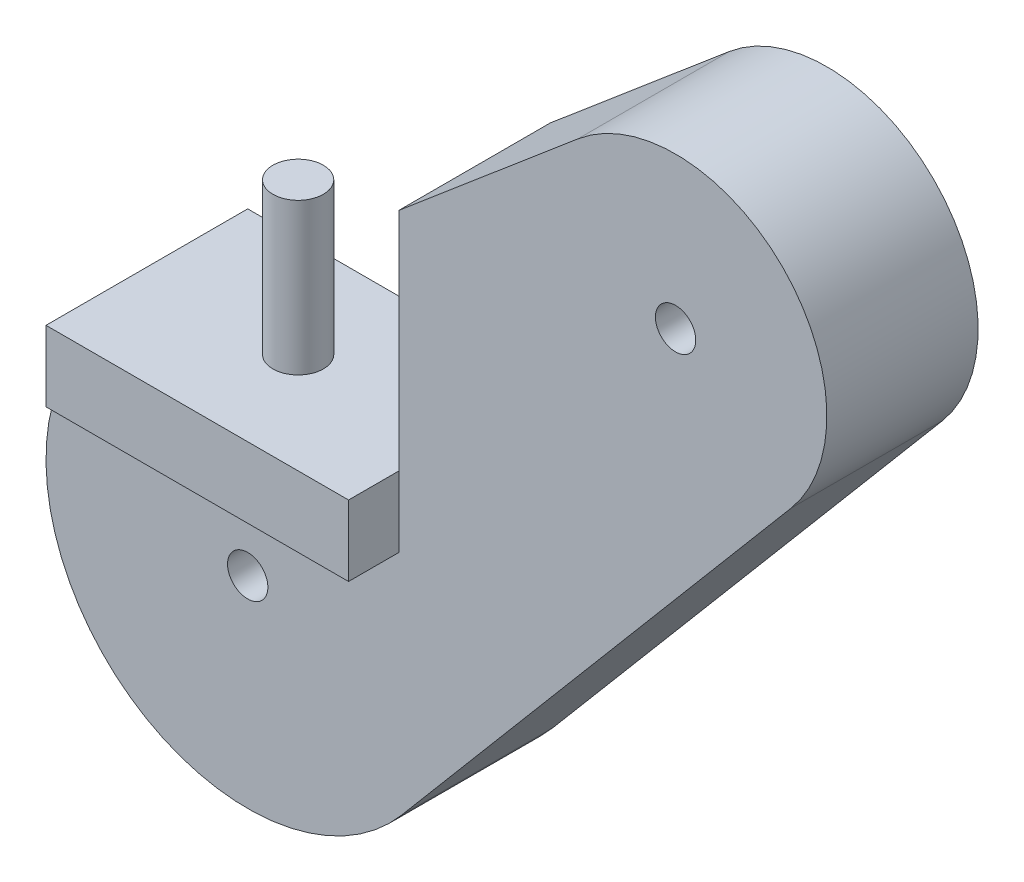
ISO-10303-21;
HEADER;
FILE_DESCRIPTION(('STEP AP214'),'2;1');
FILE_NAME('part.step','',(''),(''),'','','');
FILE_SCHEMA(('AUTOMOTIVE_DESIGN { 1 0 10303 214 1 1 1 1 }'));
ENDSEC;
DATA;
#1=APPLICATION_CONTEXT('core data for automotive mechanical design processes');
#2=APPLICATION_PROTOCOL_DEFINITION('international standard','automotive_design',2000,#1);
#3=PRODUCT_CONTEXT('',#1,'mechanical');
#4=PRODUCT('Part','Part','',(#3));
#5=PRODUCT_RELATED_PRODUCT_CATEGORY('part','',(#4));
#6=PRODUCT_DEFINITION_FORMATION('','',#4);
#7=PRODUCT_DEFINITION_CONTEXT('part definition',#1,'design');
#8=PRODUCT_DEFINITION('design','',#6,#7);
#9=PRODUCT_DEFINITION_SHAPE('','',#8);
#10=(LENGTH_UNIT() NAMED_UNIT(*) SI_UNIT(.MILLI.,.METRE.));
#11=(NAMED_UNIT(*) PLANE_ANGLE_UNIT() SI_UNIT($,.RADIAN.));
#12=(NAMED_UNIT(*) SI_UNIT($,.STERADIAN.) SOLID_ANGLE_UNIT());
#13=UNCERTAINTY_MEASURE_WITH_UNIT(LENGTH_MEASURE(1.E-05),#10,'distance_accuracy_value','');
#14=(GEOMETRIC_REPRESENTATION_CONTEXT(3) GLOBAL_UNCERTAINTY_ASSIGNED_CONTEXT((#13)) GLOBAL_UNIT_ASSIGNED_CONTEXT((#10,
#11,#12)) REPRESENTATION_CONTEXT('',''));
#15=CARTESIAN_POINT('',(0.,0.,0.));
#16=DIRECTION('',(0.,0.,1.));
#17=DIRECTION('',(1.,0.,0.));
#18=AXIS2_PLACEMENT_3D('',#15,#16,#17);
#19=CARTESIAN_POINT('',(0.,0.,15.));
#20=DIRECTION('',(0.,0.,-1.));
#21=DIRECTION('',(-1.,0.,0.));
#22=AXIS2_PLACEMENT_3D('',#19,#20,#21);
#23=CYLINDRICAL_SURFACE('',#22,20.);
#24=CARTESIAN_POINT('',(0.,0.,15.));
#25=DIRECTION('',(0.,0.,1.));
#26=DIRECTION('',(1.,0.,0.));
#27=AXIS2_PLACEMENT_3D('',#24,#25,#26);
#28=CIRCLE('',#27,20.);
#29=CARTESIAN_POINT('',(-15.,13.228756555323,15.));
#30=VERTEX_POINT('',#29);
#31=CARTESIAN_POINT('',(15.2714567397174,-12.9144341357622,15.));
#32=VERTEX_POINT('',#31);
#33=EDGE_CURVE('E181',#30,#32,#28,.T.);
#34=ORIENTED_EDGE('',*,*,#33,.F.);
#35=DIRECTION('',(0.,0.,-1.));
#36=VECTOR('',#35,1.);
#37=CARTESIAN_POINT('',(-15.,13.228756555323,15.));
#38=LINE('',#37,#36);
#39=CARTESIAN_POINT('',(-15.,13.228756555323,0.));
#40=VERTEX_POINT('',#39);
#41=EDGE_CURVE('E164',#30,#40,#38,.T.);
#42=ORIENTED_EDGE('',*,*,#41,.T.);
#43=CARTESIAN_POINT('',(0.,0.,0.));
#44=DIRECTION('',(0.,0.,1.));
#45=DIRECTION('',(1.,0.,0.));
#46=AXIS2_PLACEMENT_3D('',#43,#44,#45);
#47=CIRCLE('',#46,20.);
#48=CARTESIAN_POINT('',(15.2714567397174,-12.9144341357622,0.));
#49=VERTEX_POINT('',#48);
#50=EDGE_CURVE('E172',#40,#49,#47,.T.);
#51=ORIENTED_EDGE('',*,*,#50,.T.);
#52=DIRECTION('',(0.,0.,-1.));
#53=VECTOR('',#52,1.);
#54=CARTESIAN_POINT('',(15.2714567397174,-12.9144341357622,15.));
#55=LINE('',#54,#53);
#56=EDGE_CURVE('E11',#32,#49,#55,.T.);
#57=ORIENTED_EDGE('',*,*,#56,.F.);
#58=EDGE_LOOP('',(#34,#42,#51,#57));
#59=FACE_BOUND('',#58,.T.);
#60=ADVANCED_FACE('F37',(#59),#23,.T.);
#61=CARTESIAN_POINT('',(53.8799994259808,32.7405812693713,15.));
#62=DIRECTION('',(-0.76357283698587,0.64572170678811,0.));
#63=DIRECTION('',(-0.64572170678811,-0.763572836985871,0.));
#64=AXIS2_PLACEMENT_3D('',#61,#62,#63);
#65=PLANE('',#64);
#66=DIRECTION('',(0.64572170678811,0.76357283698587,0.));
#67=VECTOR('',#66,1.);
#68=CARTESIAN_POINT('',(53.8799994259808,32.7405812693713,0.));
#69=LINE('',#68,#67);
#70=CARTESIAN_POINT('',(53.8799994259808,32.7405812693713,0.));
#71=VERTEX_POINT('',#70);
#72=EDGE_CURVE('E193',#49,#71,#69,.T.);
#73=ORIENTED_EDGE('',*,*,#72,.T.);
#74=DIRECTION('',(0.,0.,-1.));
#75=VECTOR('',#74,1.);
#76=CARTESIAN_POINT('',(53.8799994259808,32.7405812693713,15.));
#77=LINE('',#76,#75);
#78=CARTESIAN_POINT('',(53.8799994259808,32.7405812693713,15.));
#79=VERTEX_POINT('',#78);
#80=EDGE_CURVE('E44',#79,#71,#77,.T.);
#81=ORIENTED_EDGE('',*,*,#80,.F.);
#82=DIRECTION('',(0.64572170678811,0.76357283698587,0.));
#83=VECTOR('',#82,1.);
#84=CARTESIAN_POINT('',(53.8799994259808,32.7405812693713,15.));
#85=LINE('',#84,#83);
#86=EDGE_CURVE('E183',#32,#79,#85,.T.);
#87=ORIENTED_EDGE('',*,*,#86,.F.);
#88=ORIENTED_EDGE('',*,*,#56,.T.);
#89=EDGE_LOOP('',(#73,#81,#87,#88));
#90=FACE_BOUND('',#89,.T.);
#91=ADVANCED_FACE('F216',(#90),#65,.F.);
#92=CARTESIAN_POINT('',(42.4264068711928,42.4264068711929,15.));
#93=DIRECTION('',(0.,0.,-1.));
#94=DIRECTION('',(-1.,0.,0.));
#95=AXIS2_PLACEMENT_3D('',#92,#93,#94);
#96=CYLINDRICAL_SURFACE('',#95,15.);
#97=CARTESIAN_POINT('',(42.4264068711928,42.4264068711929,0.));
#98=DIRECTION('',(0.,0.,1.));
#99=DIRECTION('',(-1.,0.,0.));
#100=AXIS2_PLACEMENT_3D('',#97,#98,#99);
#101=CIRCLE('',#100,15.);
#102=CARTESIAN_POINT('',(32.7405812693711,53.8799994259809,0.));
#103=VERTEX_POINT('',#102);
#104=EDGE_CURVE('E195',#71,#103,#101,.T.);
#105=ORIENTED_EDGE('',*,*,#104,.T.);
#106=DIRECTION('',(0.,0.,-1.));
#107=VECTOR('',#106,1.);
#108=CARTESIAN_POINT('',(32.7405812693711,53.8799994259809,15.));
#109=LINE('',#108,#107);
#110=CARTESIAN_POINT('',(32.7405812693711,53.8799994259809,15.));
#111=VERTEX_POINT('',#110);
#112=EDGE_CURVE('E191',#111,#103,#109,.T.);
#113=ORIENTED_EDGE('',*,*,#112,.F.);
#114=CARTESIAN_POINT('',(42.4264068711928,42.4264068711929,15.));
#115=DIRECTION('',(0.,0.,1.));
#116=DIRECTION('',(-1.,0.,0.));
#117=AXIS2_PLACEMENT_3D('',#114,#115,#116);
#118=CIRCLE('',#117,15.);
#119=EDGE_CURVE('E186',#79,#111,#118,.T.);
#120=ORIENTED_EDGE('',*,*,#119,.F.);
#121=ORIENTED_EDGE('',*,*,#80,.T.);
#122=EDGE_LOOP('',(#105,#113,#120,#121));
#123=FACE_BOUND('',#122,.T.);
#124=ADVANCED_FACE('F204',(#123),#96,.T.);
#125=CARTESIAN_POINT('',(-12.9144341357623,15.2714567397174,15.));
#126=DIRECTION('',(0.645721706788113,-0.763572836985868,0.));
#127=DIRECTION('',(0.763572836985868,0.645721706788113,0.));
#128=AXIS2_PLACEMENT_3D('',#125,#126,#127);
#129=PLANE('',#128);
#130=DIRECTION('',(-0.763572836985868,-0.645721706788113,0.));
#131=VECTOR('',#130,1.);
#132=CARTESIAN_POINT('',(-12.9144341357623,15.2714567397174,0.));
#133=LINE('',#132,#131);
#134=CARTESIAN_POINT('',(15.,38.8775296394823,0.));
#135=VERTEX_POINT('',#134);
#136=EDGE_CURVE('E184',#103,#135,#133,.T.);
#137=ORIENTED_EDGE('',*,*,#136,.T.);
#138=DIRECTION('',(0.,0.,1.));
#139=VECTOR('',#138,1.);
#140=CARTESIAN_POINT('',(15.,38.8775296394823,15.));
#141=LINE('',#140,#139);
#142=CARTESIAN_POINT('',(15.,38.8775296394823,15.));
#143=VERTEX_POINT('',#142);
#144=EDGE_CURVE('E130',#135,#143,#141,.T.);
#145=ORIENTED_EDGE('',*,*,#144,.T.);
#146=DIRECTION('',(-0.763572836985868,-0.645721706788113,0.));
#147=VECTOR('',#146,1.);
#148=CARTESIAN_POINT('',(-12.9144341357623,15.2714567397174,15.));
#149=LINE('',#148,#147);
#150=EDGE_CURVE('E188',#111,#143,#149,.T.);
#151=ORIENTED_EDGE('',*,*,#150,.F.);
#152=ORIENTED_EDGE('',*,*,#112,.T.);
#153=EDGE_LOOP('',(#137,#145,#151,#152));
#154=FACE_BOUND('',#153,.T.);
#155=ADVANCED_FACE('F210',(#154),#129,.F.);
#156=CARTESIAN_POINT('',(0.,0.,15.));
#157=DIRECTION('',(0.,0.,1.));
#158=DIRECTION('',(1.,0.,0.));
#159=AXIS2_PLACEMENT_3D('',#156,#157,#158);
#160=PLANE('',#159);
#161=DIRECTION('',(0.,1.,0.));
#162=VECTOR('',#161,1.);
#163=CARTESIAN_POINT('',(15.,16.5,15.));
#164=LINE('',#163,#162);
#165=CARTESIAN_POINT('',(15.,16.5,15.));
#166=VERTEX_POINT('',#165);
#167=EDGE_CURVE('E134',#166,#143,#164,.T.);
#168=ORIENTED_EDGE('',*,*,#167,.F.);
#169=DIRECTION('',(0.,1.,0.));
#170=VECTOR('',#169,1.);
#171=CARTESIAN_POINT('',(15.,0.,15.));
#172=LINE('',#171,#170);
#173=CARTESIAN_POINT('',(15.,9.5,15.));
#174=VERTEX_POINT('',#173);
#175=EDGE_CURVE('E56',#174,#166,#172,.T.);
#176=ORIENTED_EDGE('',*,*,#175,.F.);
#177=DIRECTION('',(1.,0.,0.));
#178=VECTOR('',#177,1.);
#179=CARTESIAN_POINT('',(0.,9.5,15.));
#180=LINE('',#179,#178);
#181=CARTESIAN_POINT('',(-15.,9.5,15.));
#182=VERTEX_POINT('',#181);
#183=EDGE_CURVE('E51',#182,#174,#180,.T.);
#184=ORIENTED_EDGE('',*,*,#183,.F.);
#185=DIRECTION('',(0.,-1.,0.));
#186=VECTOR('',#185,1.);
#187=CARTESIAN_POINT('',(-15.,0.,15.));
#188=LINE('',#187,#186);
#189=EDGE_CURVE('E157',#30,#182,#188,.T.);
#190=ORIENTED_EDGE('',*,*,#189,.F.);
#191=ORIENTED_EDGE('',*,*,#33,.T.);
#192=ORIENTED_EDGE('',*,*,#86,.T.);
#193=ORIENTED_EDGE('',*,*,#119,.T.);
#194=ORIENTED_EDGE('',*,*,#150,.T.);
#195=EDGE_LOOP('',(#168,#176,#184,#190,#191,#192,#193,#194));
#196=FACE_BOUND('',#195,.T.);
#197=CARTESIAN_POINT('',(0.,0.,15.));
#198=DIRECTION('',(0.,0.,1.));
#199=DIRECTION('',(1.,0.,0.));
#200=AXIS2_PLACEMENT_3D('',#197,#198,#199);
#201=CIRCLE('',#200,2.);
#202=CARTESIAN_POINT('',(2.,0.,15.));
#203=VERTEX_POINT('',#202);
#204=EDGE_CURVE('E173',#203,#203,#201,.T.);
#205=ORIENTED_EDGE('',*,*,#204,.F.);
#206=EDGE_LOOP('',(#205));
#207=FACE_BOUND('',#206,.T.);
#208=CARTESIAN_POINT('',(42.4264068711928,42.4264068711929,15.));
#209=DIRECTION('',(0.,0.,1.));
#210=DIRECTION('',(1.,0.,0.));
#211=AXIS2_PLACEMENT_3D('',#208,#209,#210);
#212=CIRCLE('',#211,2.);
#213=CARTESIAN_POINT('',(44.4264068711928,42.4264068711929,15.));
#214=VERTEX_POINT('',#213);
#215=EDGE_CURVE('E176',#214,#214,#212,.T.);
#216=ORIENTED_EDGE('',*,*,#215,.F.);
#217=EDGE_LOOP('',(#216));
#218=FACE_BOUND('',#217,.T.);
#219=ADVANCED_FACE('F212',(#196,#207,#218),#160,.T.);
#220=CARTESIAN_POINT('',(0.,0.,0.));
#221=DIRECTION('',(0.,0.,1.));
#222=DIRECTION('',(1.,0.,0.));
#223=AXIS2_PLACEMENT_3D('',#220,#221,#222);
#224=PLANE('',#223);
#225=DIRECTION('',(-1.,0.,0.));
#226=VECTOR('',#225,1.);
#227=CARTESIAN_POINT('',(-15.,16.5,0.));
#228=LINE('',#227,#226);
#229=CARTESIAN_POINT('',(15.,16.5,0.));
#230=VERTEX_POINT('',#229);
#231=CARTESIAN_POINT('',(-15.,16.5,0.));
#232=VERTEX_POINT('',#231);
#233=EDGE_CURVE('E109',#230,#232,#228,.T.);
#234=ORIENTED_EDGE('',*,*,#233,.F.);
#235=DIRECTION('',(0.,1.,0.));
#236=VECTOR('',#235,1.);
#237=CARTESIAN_POINT('',(15.,16.5,0.));
#238=LINE('',#237,#236);
#239=EDGE_CURVE('E115',#230,#135,#238,.T.);
#240=ORIENTED_EDGE('',*,*,#239,.T.);
#241=ORIENTED_EDGE('',*,*,#136,.F.);
#242=ORIENTED_EDGE('',*,*,#104,.F.);
#243=ORIENTED_EDGE('',*,*,#72,.F.);
#244=ORIENTED_EDGE('',*,*,#50,.F.);
#245=DIRECTION('',(0.,-1.,0.));
#246=VECTOR('',#245,1.);
#247=CARTESIAN_POINT('',(-15.,9.5,0.));
#248=LINE('',#247,#246);
#249=EDGE_CURVE('E119',#232,#40,#248,.T.);
#250=ORIENTED_EDGE('',*,*,#249,.F.);
#251=EDGE_LOOP('',(#234,#240,#241,#242,#243,#244,#250));
#252=FACE_BOUND('',#251,.T.);
#253=CARTESIAN_POINT('',(0.,0.,0.));
#254=DIRECTION('',(0.,0.,1.));
#255=DIRECTION('',(1.,0.,0.));
#256=AXIS2_PLACEMENT_3D('',#253,#254,#255);
#257=CIRCLE('',#256,2.);
#258=CARTESIAN_POINT('',(2.,0.,0.));
#259=VERTEX_POINT('',#258);
#260=EDGE_CURVE('E169',#259,#259,#257,.T.);
#261=ORIENTED_EDGE('',*,*,#260,.T.);
#262=EDGE_LOOP('',(#261));
#263=FACE_BOUND('',#262,.T.);
#264=CARTESIAN_POINT('',(42.4264068711928,42.4264068711929,0.));
#265=DIRECTION('',(0.,0.,1.));
#266=DIRECTION('',(1.,0.,0.));
#267=AXIS2_PLACEMENT_3D('',#264,#265,#266);
#268=CIRCLE('',#267,2.);
#269=CARTESIAN_POINT('',(44.4264068711928,42.4264068711929,0.));
#270=VERTEX_POINT('',#269);
#271=EDGE_CURVE('E168',#270,#270,#268,.T.);
#272=ORIENTED_EDGE('',*,*,#271,.T.);
#273=EDGE_LOOP('',(#272));
#274=FACE_BOUND('',#273,.T.);
#275=ADVANCED_FACE('F111',(#252,#263,#274),#224,.F.);
#276=CARTESIAN_POINT('',(42.4264068711928,42.4264068711929,0.));
#277=DIRECTION('',(0.,0.,1.));
#278=DIRECTION('',(1.,0.,0.));
#279=AXIS2_PLACEMENT_3D('',#276,#277,#278);
#280=CYLINDRICAL_SURFACE('',#279,2.);
#281=ORIENTED_EDGE('',*,*,#271,.F.);
#282=EDGE_LOOP('',(#281));
#283=FACE_BOUND('',#282,.T.);
#284=ORIENTED_EDGE('',*,*,#215,.T.);
#285=EDGE_LOOP('',(#284));
#286=FACE_BOUND('',#285,.T.);
#287=ADVANCED_FACE('F255',(#283,#286),#280,.F.);
#288=CARTESIAN_POINT('',(0.,0.,0.));
#289=DIRECTION('',(0.,0.,1.));
#290=DIRECTION('',(1.,0.,0.));
#291=AXIS2_PLACEMENT_3D('',#288,#289,#290);
#292=CYLINDRICAL_SURFACE('',#291,2.);
#293=ORIENTED_EDGE('',*,*,#260,.F.);
#294=EDGE_LOOP('',(#293));
#295=FACE_BOUND('',#294,.T.);
#296=ORIENTED_EDGE('',*,*,#204,.T.);
#297=EDGE_LOOP('',(#296));
#298=FACE_BOUND('',#297,.T.);
#299=ADVANCED_FACE('F260',(#295,#298),#292,.F.);
#300=CARTESIAN_POINT('',(-15.,9.5,0.));
#301=DIRECTION('',(-1.,0.,0.));
#302=DIRECTION('',(0.,0.,1.));
#303=AXIS2_PLACEMENT_3D('',#300,#301,#302);
#304=PLANE('',#303);
#305=ORIENTED_EDGE('',*,*,#41,.F.);
#306=ORIENTED_EDGE('',*,*,#189,.T.);
#307=DIRECTION('',(0.,0.,1.));
#308=VECTOR('',#307,1.);
#309=CARTESIAN_POINT('',(-15.,9.5,0.));
#310=LINE('',#309,#308);
#311=CARTESIAN_POINT('',(-15.,9.5,20.));
#312=VERTEX_POINT('',#311);
#313=EDGE_CURVE('E158',#182,#312,#310,.T.);
#314=ORIENTED_EDGE('',*,*,#313,.T.);
#315=DIRECTION('',(0.,-1.,0.));
#316=VECTOR('',#315,1.);
#317=CARTESIAN_POINT('',(-15.,9.5,20.));
#318=LINE('',#317,#316);
#319=CARTESIAN_POINT('',(-15.,16.5,20.));
#320=VERTEX_POINT('',#319);
#321=EDGE_CURVE('E149',#320,#312,#318,.T.);
#322=ORIENTED_EDGE('',*,*,#321,.F.);
#323=DIRECTION('',(0.,0.,1.));
#324=VECTOR('',#323,1.);
#325=CARTESIAN_POINT('',(-15.,16.5,0.));
#326=LINE('',#325,#324);
#327=EDGE_CURVE('E160',#232,#320,#326,.T.);
#328=ORIENTED_EDGE('',*,*,#327,.F.);
#329=ORIENTED_EDGE('',*,*,#249,.T.);
#330=EDGE_LOOP('',(#305,#306,#314,#322,#328,#329));
#331=FACE_BOUND('',#330,.T.);
#332=ADVANCED_FACE('F220',(#331),#304,.T.);
#333=CARTESIAN_POINT('',(-15.,16.5,0.));
#334=DIRECTION('',(0.,1.,0.));
#335=DIRECTION('',(0.,0.,1.));
#336=AXIS2_PLACEMENT_3D('',#333,#334,#335);
#337=PLANE('',#336);
#338=CARTESIAN_POINT('',(0.,16.5,10.));
#339=DIRECTION('',(0.,1.,0.));
#340=DIRECTION('',(0.,0.,1.));
#341=AXIS2_PLACEMENT_3D('',#338,#339,#340);
#342=CIRCLE('',#341,2.5);
#343=CARTESIAN_POINT('',(0.,16.5,12.5));
#344=VERTEX_POINT('',#343);
#345=EDGE_CURVE('E139',#344,#344,#342,.T.);
#346=ORIENTED_EDGE('',*,*,#345,.F.);
#347=EDGE_LOOP('',(#346));
#348=FACE_BOUND('',#347,.T.);
#349=ORIENTED_EDGE('',*,*,#327,.T.);
#350=DIRECTION('',(-1.,0.,0.));
#351=VECTOR('',#350,1.);
#352=CARTESIAN_POINT('',(-15.,16.5,20.));
#353=LINE('',#352,#351);
#354=CARTESIAN_POINT('',(15.,16.5,20.));
#355=VERTEX_POINT('',#354);
#356=EDGE_CURVE('E146',#355,#320,#353,.T.);
#357=ORIENTED_EDGE('',*,*,#356,.F.);
#358=DIRECTION('',(0.,0.,1.));
#359=VECTOR('',#358,1.);
#360=CARTESIAN_POINT('',(15.,16.5,0.));
#361=LINE('',#360,#359);
#362=EDGE_CURVE('E128',#166,#355,#361,.T.);
#363=ORIENTED_EDGE('',*,*,#362,.F.);
#364=DIRECTION('',(0.,0.,1.));
#365=VECTOR('',#364,1.);
#366=CARTESIAN_POINT('',(15.,16.5,0.));
#367=LINE('',#366,#365);
#368=EDGE_CURVE('E125',#230,#166,#367,.T.);
#369=ORIENTED_EDGE('',*,*,#368,.F.);
#370=ORIENTED_EDGE('',*,*,#233,.T.);
#371=EDGE_LOOP('',(#349,#357,#363,#369,#370));
#372=FACE_BOUND('',#371,.T.);
#373=ADVANCED_FACE('F126',(#348,#372),#337,.T.);
#374=CARTESIAN_POINT('',(15.,9.5,0.));
#375=DIRECTION('',(1.,0.,0.));
#376=DIRECTION('',(0.,0.,-1.));
#377=AXIS2_PLACEMENT_3D('',#374,#375,#376);
#378=PLANE('',#377);
#379=DIRECTION('',(0.,0.,1.));
#380=VECTOR('',#379,1.);
#381=CARTESIAN_POINT('',(15.,9.5,0.));
#382=LINE('',#381,#380);
#383=CARTESIAN_POINT('',(15.,9.5,20.));
#384=VERTEX_POINT('',#383);
#385=EDGE_CURVE('E155',#174,#384,#382,.T.);
#386=ORIENTED_EDGE('',*,*,#385,.F.);
#387=ORIENTED_EDGE('',*,*,#175,.T.);
#388=ORIENTED_EDGE('',*,*,#362,.T.);
#389=DIRECTION('',(0.,1.,0.));
#390=VECTOR('',#389,1.);
#391=CARTESIAN_POINT('',(15.,9.5,20.));
#392=LINE('',#391,#390);
#393=EDGE_CURVE('E143',#384,#355,#392,.T.);
#394=ORIENTED_EDGE('',*,*,#393,.F.);
#395=EDGE_LOOP('',(#386,#387,#388,#394));
#396=FACE_BOUND('',#395,.T.);
#397=ADVANCED_FACE('F228',(#396),#378,.T.);
#398=CARTESIAN_POINT('',(-15.,9.5,0.));
#399=DIRECTION('',(0.,-1.,0.));
#400=DIRECTION('',(1.,0.,0.));
#401=AXIS2_PLACEMENT_3D('',#398,#399,#400);
#402=PLANE('',#401);
#403=ORIENTED_EDGE('',*,*,#313,.F.);
#404=ORIENTED_EDGE('',*,*,#183,.T.);
#405=ORIENTED_EDGE('',*,*,#385,.T.);
#406=DIRECTION('',(1.,0.,0.));
#407=VECTOR('',#406,1.);
#408=CARTESIAN_POINT('',(-15.,9.5,20.));
#409=LINE('',#408,#407);
#410=EDGE_CURVE('E122',#312,#384,#409,.T.);
#411=ORIENTED_EDGE('',*,*,#410,.F.);
#412=EDGE_LOOP('',(#403,#404,#405,#411));
#413=FACE_BOUND('',#412,.T.);
#414=ADVANCED_FACE('F231',(#413),#402,.T.);
#415=CARTESIAN_POINT('',(0.,0.,20.));
#416=DIRECTION('',(0.,0.,-1.));
#417=DIRECTION('',(-1.,0.,0.));
#418=AXIS2_PLACEMENT_3D('',#415,#416,#417);
#419=PLANE('',#418);
#420=ORIENTED_EDGE('',*,*,#393,.T.);
#421=ORIENTED_EDGE('',*,*,#356,.T.);
#422=ORIENTED_EDGE('',*,*,#321,.T.);
#423=ORIENTED_EDGE('',*,*,#410,.T.);
#424=EDGE_LOOP('',(#420,#421,#422,#423));
#425=FACE_BOUND('',#424,.T.);
#426=ADVANCED_FACE('F223',(#425),#419,.F.);
#427=CARTESIAN_POINT('',(15.,16.5,0.));
#428=DIRECTION('',(1.,0.,0.));
#429=DIRECTION('',(0.,0.,-1.));
#430=AXIS2_PLACEMENT_3D('',#427,#428,#429);
#431=PLANE('',#430);
#432=ORIENTED_EDGE('',*,*,#239,.F.);
#433=ORIENTED_EDGE('',*,*,#368,.T.);
#434=ORIENTED_EDGE('',*,*,#167,.T.);
#435=ORIENTED_EDGE('',*,*,#144,.F.);
#436=EDGE_LOOP('',(#432,#433,#434,#435));
#437=FACE_BOUND('',#436,.T.);
#438=ADVANCED_FACE('F132',(#437),#431,.F.);
#439=CARTESIAN_POINT('',(0.,31.5,10.));
#440=DIRECTION('',(0.,-1.,0.));
#441=DIRECTION('',(0.,0.,-1.));
#442=AXIS2_PLACEMENT_3D('',#439,#440,#441);
#443=CYLINDRICAL_SURFACE('',#442,2.5);
#444=CARTESIAN_POINT('',(0.,31.5,10.));
#445=DIRECTION('',(0.,1.,0.));
#446=DIRECTION('',(0.,0.,1.));
#447=AXIS2_PLACEMENT_3D('',#444,#445,#446);
#448=CIRCLE('',#447,2.5);
#449=CARTESIAN_POINT('',(0.,31.5,12.5));
#450=VERTEX_POINT('',#449);
#451=EDGE_CURVE('E136',#450,#450,#448,.T.);
#452=ORIENTED_EDGE('',*,*,#451,.F.);
#453=EDGE_LOOP('',(#452));
#454=FACE_BOUND('',#453,.T.);
#455=ORIENTED_EDGE('',*,*,#345,.T.);
#456=EDGE_LOOP('',(#455));
#457=FACE_BOUND('',#456,.T.);
#458=ADVANCED_FACE('F292',(#454,#457),#443,.T.);
#459=CARTESIAN_POINT('',(0.,31.5,10.));
#460=DIRECTION('',(0.,1.,0.));
#461=DIRECTION('',(0.,0.,1.));
#462=AXIS2_PLACEMENT_3D('',#459,#460,#461);
#463=PLANE('',#462);
#464=ORIENTED_EDGE('',*,*,#451,.T.);
#465=EDGE_LOOP('',(#464));
#466=FACE_BOUND('',#465,.T.);
#467=ADVANCED_FACE('F304',(#466),#463,.T.);
#468=CLOSED_SHELL('',(#60,#91,#124,#155,#219,#275,#287,#299,#332,#373,#397,#414,#426,#438,#458,#467));
#469=MANIFOLD_SOLID_BREP('B2',#468);
#470=ADVANCED_BREP_SHAPE_REPRESENTATION('',(#18,#469),#14);
#471=SHAPE_DEFINITION_REPRESENTATION(#9,#470);
ENDSEC;
END-ISO-10303-21;
